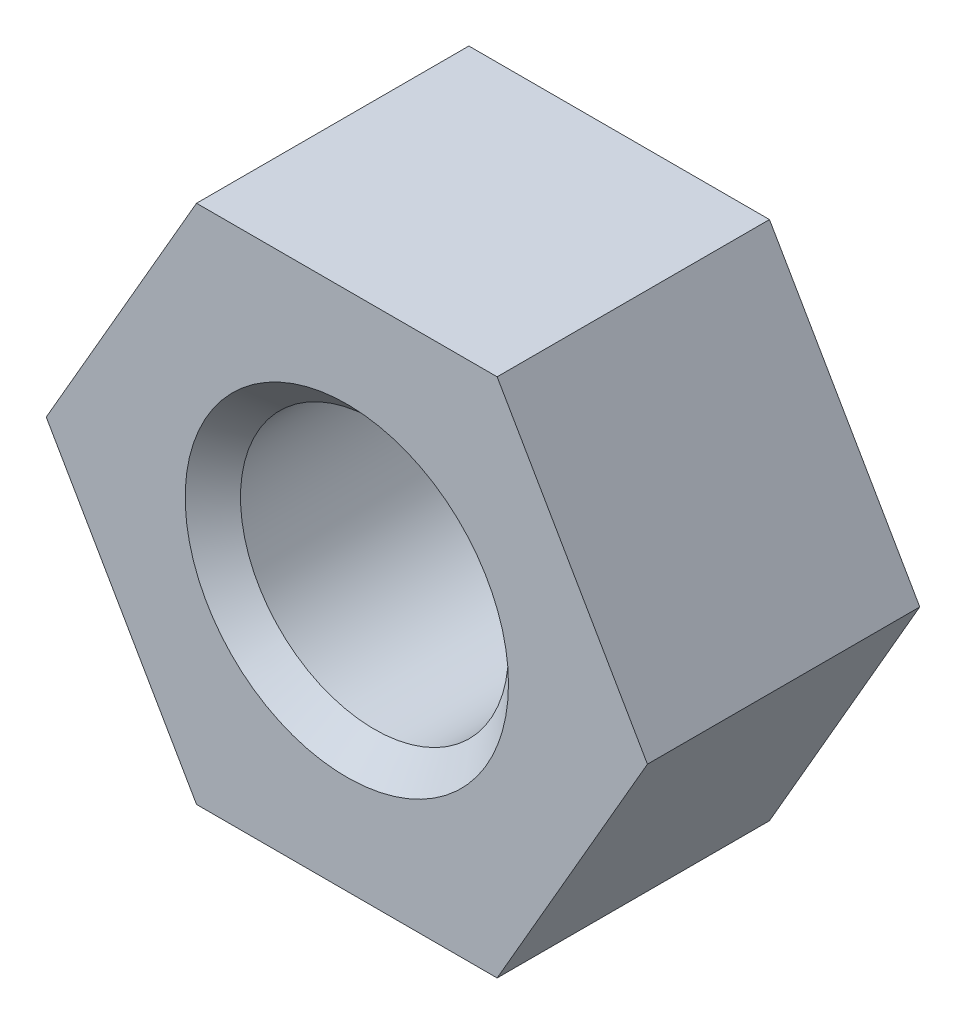
ISO-10303-21;
HEADER;
FILE_DESCRIPTION(('STEP AP214'),'2;1');
FILE_NAME('part.step','',(''),(''),'','','');
FILE_SCHEMA(('AUTOMOTIVE_DESIGN { 1 0 10303 214 1 1 1 1 }'));
ENDSEC;
DATA;
#1=APPLICATION_CONTEXT('core data for automotive mechanical design processes');
#2=APPLICATION_PROTOCOL_DEFINITION('international standard','automotive_design',2000,#1);
#3=PRODUCT_CONTEXT('',#1,'mechanical');
#4=PRODUCT('Part','Part','',(#3));
#5=PRODUCT_RELATED_PRODUCT_CATEGORY('part','',(#4));
#6=PRODUCT_DEFINITION_FORMATION('','',#4);
#7=PRODUCT_DEFINITION_CONTEXT('part definition',#1,'design');
#8=PRODUCT_DEFINITION('design','',#6,#7);
#9=PRODUCT_DEFINITION_SHAPE('','',#8);
#10=(LENGTH_UNIT() NAMED_UNIT(*) SI_UNIT(.MILLI.,.METRE.));
#11=(NAMED_UNIT(*) PLANE_ANGLE_UNIT() SI_UNIT($,.RADIAN.));
#12=(NAMED_UNIT(*) SI_UNIT($,.STERADIAN.) SOLID_ANGLE_UNIT());
#13=UNCERTAINTY_MEASURE_WITH_UNIT(LENGTH_MEASURE(1.E-05),#10,'distance_accuracy_value','');
#14=(GEOMETRIC_REPRESENTATION_CONTEXT(3) GLOBAL_UNCERTAINTY_ASSIGNED_CONTEXT((#13)) GLOBAL_UNIT_ASSIGNED_CONTEXT((#10,
#11,#12)) REPRESENTATION_CONTEXT('',''));
#15=CARTESIAN_POINT('',(0.,0.,0.));
#16=DIRECTION('',(0.,0.,1.));
#17=DIRECTION('',(1.,0.,0.));
#18=AXIS2_PLACEMENT_3D('',#15,#16,#17);
#19=CARTESIAN_POINT('',(0.,0.,6.8));
#20=DIRECTION('',(0.,0.,1.));
#21=DIRECTION('',(1.,0.,0.));
#22=AXIS2_PLACEMENT_3D('',#19,#20,#21);
#23=PLANE('',#22);
#24=CARTESIAN_POINT('',(0.,0.,6.8));
#25=DIRECTION('',(0.,0.,1.));
#26=DIRECTION('',(1.,0.,0.));
#27=AXIS2_PLACEMENT_3D('',#24,#25,#26);
#28=CIRCLE('',#27,4.03600000000001);
#29=CARTESIAN_POINT('',(4.03600000000001,0.,6.8));
#30=VERTEX_POINT('',#29);
#31=EDGE_CURVE('E11',#30,#30,#28,.F.);
#32=ORIENTED_EDGE('',*,*,#31,.T.);
#33=EDGE_LOOP('',(#32));
#34=FACE_BOUND('',#33,.T.);
#35=DIRECTION('',(-1.,0.,0.));
#36=VECTOR('',#35,1.);
#37=CARTESIAN_POINT('',(3.75277674973257,6.50000000000001,6.8));
#38=LINE('',#37,#36);
#39=CARTESIAN_POINT('',(3.75277674973257,6.50000000000001,6.8));
#40=VERTEX_POINT('',#39);
#41=CARTESIAN_POINT('',(-3.75277674973257,6.50000000000001,6.8));
#42=VERTEX_POINT('',#41);
#43=EDGE_CURVE('E133',#40,#42,#38,.T.);
#44=ORIENTED_EDGE('',*,*,#43,.T.);
#45=DIRECTION('',(-0.5,-0.866025403784439,0.));
#46=VECTOR('',#45,1.);
#47=CARTESIAN_POINT('',(-3.75277674973257,6.50000000000001,6.8));
#48=LINE('',#47,#46);
#49=CARTESIAN_POINT('',(-7.50555349946513,0.,6.8));
#50=VERTEX_POINT('',#49);
#51=EDGE_CURVE('E93',#42,#50,#48,.T.);
#52=ORIENTED_EDGE('',*,*,#51,.T.);
#53=DIRECTION('',(0.5,-0.866025403784439,0.));
#54=VECTOR('',#53,1.);
#55=CARTESIAN_POINT('',(-7.50555349946513,0.,6.8));
#56=LINE('',#55,#54);
#57=CARTESIAN_POINT('',(-3.75277674973257,-6.5,6.8));
#58=VERTEX_POINT('',#57);
#59=EDGE_CURVE('E105',#50,#58,#56,.T.);
#60=ORIENTED_EDGE('',*,*,#59,.T.);
#61=DIRECTION('',(1.,0.,0.));
#62=VECTOR('',#61,1.);
#63=CARTESIAN_POINT('',(-3.75277674973257,-6.5,6.8));
#64=LINE('',#63,#62);
#65=CARTESIAN_POINT('',(3.75277674973257,-6.5,6.8));
#66=VERTEX_POINT('',#65);
#67=EDGE_CURVE('E100',#58,#66,#64,.T.);
#68=ORIENTED_EDGE('',*,*,#67,.T.);
#69=DIRECTION('',(0.5,0.866025403784439,0.));
#70=VECTOR('',#69,1.);
#71=CARTESIAN_POINT('',(3.75277674973257,-6.5,6.8));
#72=LINE('',#71,#70);
#73=CARTESIAN_POINT('',(7.50555349946513,0.,6.8));
#74=VERTEX_POINT('',#73);
#75=EDGE_CURVE('E103',#66,#74,#72,.T.);
#76=ORIENTED_EDGE('',*,*,#75,.T.);
#77=DIRECTION('',(-0.5,0.866025403784439,0.));
#78=VECTOR('',#77,1.);
#79=CARTESIAN_POINT('',(7.50555349946513,0.,6.8));
#80=LINE('',#79,#78);
#81=EDGE_CURVE('E55',#74,#40,#80,.T.);
#82=ORIENTED_EDGE('',*,*,#81,.T.);
#83=EDGE_LOOP('',(#44,#52,#60,#68,#76,#82));
#84=FACE_BOUND('',#83,.T.);
#85=ADVANCED_FACE('F38',(#34,#84),#23,.T.);
#86=CARTESIAN_POINT('',(0.,0.,0.));
#87=DIRECTION('',(0.,0.,1.));
#88=DIRECTION('',(1.,0.,0.));
#89=AXIS2_PLACEMENT_3D('',#86,#87,#88);
#90=PLANE('',#89);
#91=CARTESIAN_POINT('',(0.,0.,0.));
#92=DIRECTION('',(0.,0.,1.));
#93=DIRECTION('',(1.,0.,0.));
#94=AXIS2_PLACEMENT_3D('',#91,#92,#93);
#95=CIRCLE('',#94,4.036);
#96=CARTESIAN_POINT('',(4.036,0.,0.));
#97=VERTEX_POINT('',#96);
#98=EDGE_CURVE('E142',#97,#97,#95,.T.);
#99=ORIENTED_EDGE('',*,*,#98,.T.);
#100=EDGE_LOOP('',(#99));
#101=FACE_BOUND('',#100,.T.);
#102=DIRECTION('',(-1.,0.,0.));
#103=VECTOR('',#102,1.);
#104=CARTESIAN_POINT('',(3.75277674973257,6.50000000000001,0.));
#105=LINE('',#104,#103);
#106=CARTESIAN_POINT('',(3.75277674973257,6.50000000000001,0.));
#107=VERTEX_POINT('',#106);
#108=CARTESIAN_POINT('',(-3.75277674973257,6.50000000000001,0.));
#109=VERTEX_POINT('',#108);
#110=EDGE_CURVE('E123',#107,#109,#105,.T.);
#111=ORIENTED_EDGE('',*,*,#110,.F.);
#112=DIRECTION('',(-0.5,0.866025403784439,0.));
#113=VECTOR('',#112,1.);
#114=CARTESIAN_POINT('',(7.50555349946513,0.,0.));
#115=LINE('',#114,#113);
#116=CARTESIAN_POINT('',(7.50555349946513,0.,0.));
#117=VERTEX_POINT('',#116);
#118=EDGE_CURVE('E84',#117,#107,#115,.T.);
#119=ORIENTED_EDGE('',*,*,#118,.F.);
#120=DIRECTION('',(0.5,0.866025403784439,0.));
#121=VECTOR('',#120,1.);
#122=CARTESIAN_POINT('',(3.75277674973257,-6.5,0.));
#123=LINE('',#122,#121);
#124=CARTESIAN_POINT('',(3.75277674973257,-6.5,0.));
#125=VERTEX_POINT('',#124);
#126=EDGE_CURVE('E78',#125,#117,#123,.T.);
#127=ORIENTED_EDGE('',*,*,#126,.F.);
#128=DIRECTION('',(1.,0.,0.));
#129=VECTOR('',#128,1.);
#130=CARTESIAN_POINT('',(-3.75277674973257,-6.5,0.));
#131=LINE('',#130,#129);
#132=CARTESIAN_POINT('',(-3.75277674973257,-6.5,0.));
#133=VERTEX_POINT('',#132);
#134=EDGE_CURVE('E113',#133,#125,#131,.T.);
#135=ORIENTED_EDGE('',*,*,#134,.F.);
#136=DIRECTION('',(0.5,-0.866025403784439,0.));
#137=VECTOR('',#136,1.);
#138=CARTESIAN_POINT('',(-7.50555349946513,0.,0.));
#139=LINE('',#138,#137);
#140=CARTESIAN_POINT('',(-7.50555349946513,0.,0.));
#141=VERTEX_POINT('',#140);
#142=EDGE_CURVE('E128',#141,#133,#139,.T.);
#143=ORIENTED_EDGE('',*,*,#142,.F.);
#144=DIRECTION('',(-0.5,-0.866025403784439,0.));
#145=VECTOR('',#144,1.);
#146=CARTESIAN_POINT('',(-3.75277674973257,6.50000000000001,0.));
#147=LINE('',#146,#145);
#148=EDGE_CURVE('E126',#109,#141,#147,.T.);
#149=ORIENTED_EDGE('',*,*,#148,.F.);
#150=EDGE_LOOP('',(#111,#119,#127,#135,#143,#149));
#151=FACE_BOUND('',#150,.T.);
#152=ADVANCED_FACE('F158',(#101,#151),#90,.F.);
#153=CARTESIAN_POINT('',(3.75277674973257,6.50000000000001,6.8));
#154=DIRECTION('',(0.,-1.,0.));
#155=DIRECTION('',(0.,0.,-1.));
#156=AXIS2_PLACEMENT_3D('',#153,#154,#155);
#157=PLANE('',#156);
#158=ORIENTED_EDGE('',*,*,#110,.T.);
#159=DIRECTION('',(0.,0.,-1.));
#160=VECTOR('',#159,1.);
#161=CARTESIAN_POINT('',(-3.75277674973257,6.50000000000001,6.8));
#162=LINE('',#161,#160);
#163=EDGE_CURVE('E140',#42,#109,#162,.T.);
#164=ORIENTED_EDGE('',*,*,#163,.F.);
#165=ORIENTED_EDGE('',*,*,#43,.F.);
#166=DIRECTION('',(0.,0.,-1.));
#167=VECTOR('',#166,1.);
#168=CARTESIAN_POINT('',(3.75277674973257,6.50000000000001,6.8));
#169=LINE('',#168,#167);
#170=EDGE_CURVE('E119',#40,#107,#169,.T.);
#171=ORIENTED_EDGE('',*,*,#170,.T.);
#172=EDGE_LOOP('',(#158,#164,#165,#171));
#173=FACE_BOUND('',#172,.T.);
#174=ADVANCED_FACE('F161',(#173),#157,.F.);
#175=CARTESIAN_POINT('',(-3.75277674973257,6.50000000000001,6.8));
#176=DIRECTION('',(0.866025403784439,-0.5,0.));
#177=DIRECTION('',(0.5,0.866025403784439,0.));
#178=AXIS2_PLACEMENT_3D('',#175,#176,#177);
#179=PLANE('',#178);
#180=ORIENTED_EDGE('',*,*,#148,.T.);
#181=DIRECTION('',(0.,0.,-1.));
#182=VECTOR('',#181,1.);
#183=CARTESIAN_POINT('',(-7.50555349946513,0.,6.8));
#184=LINE('',#183,#182);
#185=EDGE_CURVE('E137',#50,#141,#184,.T.);
#186=ORIENTED_EDGE('',*,*,#185,.F.);
#187=ORIENTED_EDGE('',*,*,#51,.F.);
#188=ORIENTED_EDGE('',*,*,#163,.T.);
#189=EDGE_LOOP('',(#180,#186,#187,#188));
#190=FACE_BOUND('',#189,.T.);
#191=ADVANCED_FACE('F219',(#190),#179,.F.);
#192=CARTESIAN_POINT('',(-7.50555349946513,0.,6.8));
#193=DIRECTION('',(0.866025403784439,0.5,0.));
#194=DIRECTION('',(-0.5,0.866025403784439,0.));
#195=AXIS2_PLACEMENT_3D('',#192,#193,#194);
#196=PLANE('',#195);
#197=ORIENTED_EDGE('',*,*,#142,.T.);
#198=DIRECTION('',(0.,0.,-1.));
#199=VECTOR('',#198,1.);
#200=CARTESIAN_POINT('',(-3.75277674973257,-6.5,6.8));
#201=LINE('',#200,#199);
#202=EDGE_CURVE('E114',#58,#133,#201,.T.);
#203=ORIENTED_EDGE('',*,*,#202,.F.);
#204=ORIENTED_EDGE('',*,*,#59,.F.);
#205=ORIENTED_EDGE('',*,*,#185,.T.);
#206=EDGE_LOOP('',(#197,#203,#204,#205));
#207=FACE_BOUND('',#206,.T.);
#208=ADVANCED_FACE('F212',(#207),#196,.F.);
#209=CARTESIAN_POINT('',(-3.75277674973257,-6.5,6.8));
#210=DIRECTION('',(0.,1.,0.));
#211=DIRECTION('',(-1.,0.,0.));
#212=AXIS2_PLACEMENT_3D('',#209,#210,#211);
#213=PLANE('',#212);
#214=ORIENTED_EDGE('',*,*,#134,.T.);
#215=DIRECTION('',(0.,0.,-1.));
#216=VECTOR('',#215,1.);
#217=CARTESIAN_POINT('',(3.75277674973257,-6.5,6.8));
#218=LINE('',#217,#216);
#219=EDGE_CURVE('E110',#66,#125,#218,.T.);
#220=ORIENTED_EDGE('',*,*,#219,.F.);
#221=ORIENTED_EDGE('',*,*,#67,.F.);
#222=ORIENTED_EDGE('',*,*,#202,.T.);
#223=EDGE_LOOP('',(#214,#220,#221,#222));
#224=FACE_BOUND('',#223,.T.);
#225=ADVANCED_FACE('F111',(#224),#213,.F.);
#226=CARTESIAN_POINT('',(3.75277674973257,-6.5,6.8));
#227=DIRECTION('',(-0.866025403784439,0.5,0.));
#228=DIRECTION('',(-0.5,-0.866025403784439,0.));
#229=AXIS2_PLACEMENT_3D('',#226,#227,#228);
#230=PLANE('',#229);
#231=ORIENTED_EDGE('',*,*,#126,.T.);
#232=DIRECTION('',(0.,0.,-1.));
#233=VECTOR('',#232,1.);
#234=CARTESIAN_POINT('',(7.50555349946513,0.,6.8));
#235=LINE('',#234,#233);
#236=EDGE_CURVE('E115',#74,#117,#235,.T.);
#237=ORIENTED_EDGE('',*,*,#236,.F.);
#238=ORIENTED_EDGE('',*,*,#75,.F.);
#239=ORIENTED_EDGE('',*,*,#219,.T.);
#240=EDGE_LOOP('',(#231,#237,#238,#239));
#241=FACE_BOUND('',#240,.T.);
#242=ADVANCED_FACE('F117',(#241),#230,.F.);
#243=CARTESIAN_POINT('',(7.50555349946513,0.,6.8));
#244=DIRECTION('',(-0.866025403784439,-0.5,0.));
#245=DIRECTION('',(0.5,-0.866025403784439,0.));
#246=AXIS2_PLACEMENT_3D('',#243,#244,#245);
#247=PLANE('',#246);
#248=ORIENTED_EDGE('',*,*,#118,.T.);
#249=ORIENTED_EDGE('',*,*,#170,.F.);
#250=ORIENTED_EDGE('',*,*,#81,.F.);
#251=ORIENTED_EDGE('',*,*,#236,.T.);
#252=EDGE_LOOP('',(#248,#249,#250,#251));
#253=FACE_BOUND('',#252,.T.);
#254=ADVANCED_FACE('F168',(#253),#247,.F.);
#255=CARTESIAN_POINT('',(0.,0.,6.8));
#256=DIRECTION('',(0.,0.,-1.));
#257=DIRECTION('',(-1.,0.,0.));
#258=AXIS2_PLACEMENT_3D('',#255,#256,#257);
#259=CYLINDRICAL_SURFACE('',#258,3.3455);
#260=CARTESIAN_POINT('',(0.,0.,0.690500000000004));
#261=DIRECTION('',(0.,0.,1.));
#262=DIRECTION('',(1.,0.,0.));
#263=AXIS2_PLACEMENT_3D('',#260,#261,#262);
#264=CIRCLE('',#263,3.3455);
#265=CARTESIAN_POINT('',(3.3455,0.,0.690500000000004));
#266=VERTEX_POINT('',#265);
#267=EDGE_CURVE('E47',#266,#266,#264,.F.);
#268=ORIENTED_EDGE('',*,*,#267,.T.);
#269=EDGE_LOOP('',(#268));
#270=FACE_BOUND('',#269,.T.);
#271=CARTESIAN_POINT('',(0.,0.,6.1095));
#272=DIRECTION('',(0.,0.,1.));
#273=DIRECTION('',(1.,0.,0.));
#274=AXIS2_PLACEMENT_3D('',#271,#272,#273);
#275=CIRCLE('',#274,3.3455);
#276=CARTESIAN_POINT('',(3.3455,0.,6.1095));
#277=VERTEX_POINT('',#276);
#278=EDGE_CURVE('E145',#277,#277,#275,.T.);
#279=ORIENTED_EDGE('',*,*,#278,.T.);
#280=EDGE_LOOP('',(#279));
#281=FACE_BOUND('',#280,.T.);
#282=ADVANCED_FACE('F150',(#270,#281),#259,.F.);
#283=CARTESIAN_POINT('',(0.,0.,0.));
#284=DIRECTION('',(0.,0.,-1.));
#285=DIRECTION('',(-1.,0.,0.));
#286=AXIS2_PLACEMENT_3D('',#283,#284,#285);
#287=CONICAL_SURFACE('',#286,4.036,0.785398163397447);
#288=ORIENTED_EDGE('',*,*,#267,.F.);
#289=EDGE_LOOP('',(#288));
#290=FACE_BOUND('',#289,.T.);
#291=ORIENTED_EDGE('',*,*,#98,.F.);
#292=EDGE_LOOP('',(#291));
#293=FACE_BOUND('',#292,.T.);
#294=ADVANCED_FACE('F153',(#290,#293),#287,.F.);
#295=CARTESIAN_POINT('',(0.,0.,6.1095));
#296=DIRECTION('',(0.,0.,1.));
#297=DIRECTION('',(1.,0.,0.));
#298=AXIS2_PLACEMENT_3D('',#295,#296,#297);
#299=CONICAL_SURFACE('',#298,3.3455,0.785398163397452);
#300=ORIENTED_EDGE('',*,*,#31,.F.);
#301=EDGE_LOOP('',(#300));
#302=FACE_BOUND('',#301,.T.);
#303=ORIENTED_EDGE('',*,*,#278,.F.);
#304=EDGE_LOOP('',(#303));
#305=FACE_BOUND('',#304,.T.);
#306=ADVANCED_FACE('F40',(#302,#305),#299,.F.);
#307=CLOSED_SHELL('',(#85,#152,#174,#191,#208,#225,#242,#254,#282,#294,#306));
#308=MANIFOLD_SOLID_BREP('B2',#307);
#309=ADVANCED_BREP_SHAPE_REPRESENTATION('',(#18,#308),#14);
#310=SHAPE_DEFINITION_REPRESENTATION(#9,#309);
ENDSEC;
END-ISO-10303-21;
